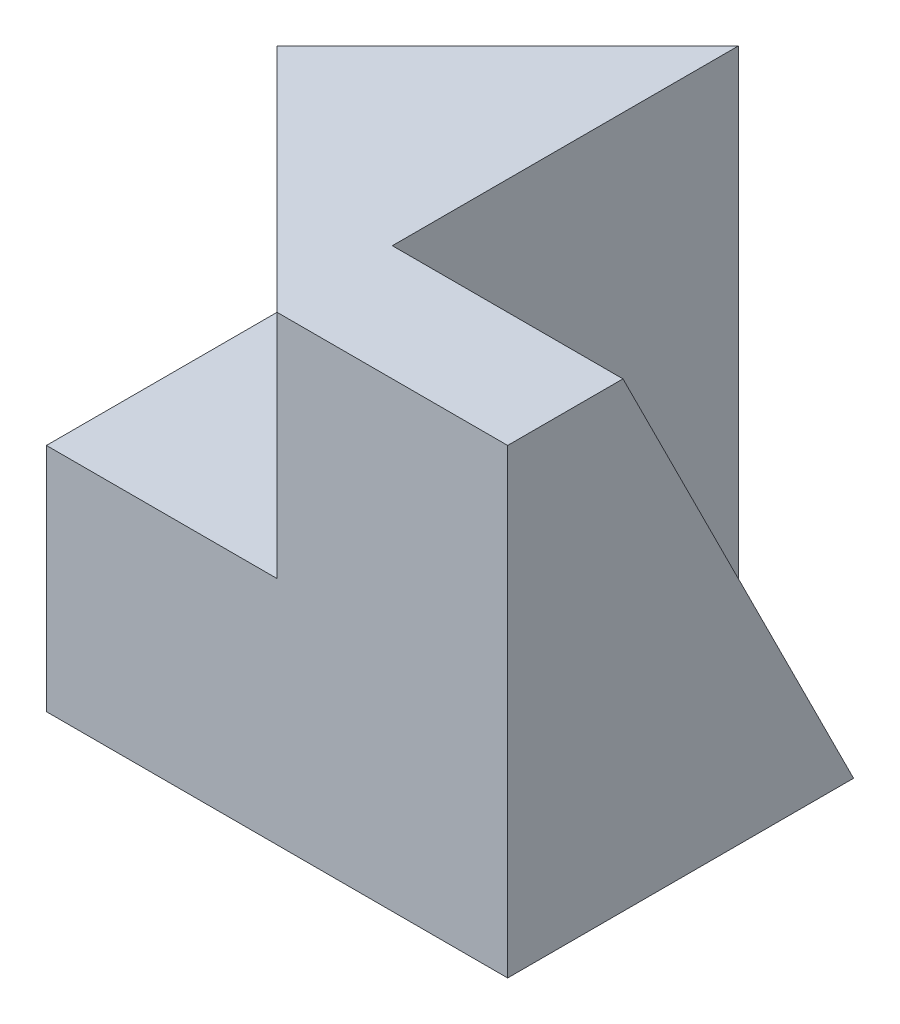
ISO-10303-21;
HEADER;
FILE_DESCRIPTION(('STEP AP214'),'2;1');
FILE_NAME('part.step','',(''),(''),'','','');
FILE_SCHEMA(('AUTOMOTIVE_DESIGN { 1 0 10303 214 1 1 1 1 }'));
ENDSEC;
DATA;
#1=APPLICATION_CONTEXT('core data for automotive mechanical design processes');
#2=APPLICATION_PROTOCOL_DEFINITION('international standard','automotive_design',2000,#1);
#3=PRODUCT_CONTEXT('',#1,'mechanical');
#4=PRODUCT('Part','Part','',(#3));
#5=PRODUCT_RELATED_PRODUCT_CATEGORY('part','',(#4));
#6=PRODUCT_DEFINITION_FORMATION('','',#4);
#7=PRODUCT_DEFINITION_CONTEXT('part definition',#1,'design');
#8=PRODUCT_DEFINITION('design','',#6,#7);
#9=PRODUCT_DEFINITION_SHAPE('','',#8);
#10=(LENGTH_UNIT() NAMED_UNIT(*) SI_UNIT(.MILLI.,.METRE.));
#11=(NAMED_UNIT(*) PLANE_ANGLE_UNIT() SI_UNIT($,.RADIAN.));
#12=(NAMED_UNIT(*) SI_UNIT($,.STERADIAN.) SOLID_ANGLE_UNIT());
#13=UNCERTAINTY_MEASURE_WITH_UNIT(LENGTH_MEASURE(1.E-05),#10,'distance_accuracy_value','');
#14=(GEOMETRIC_REPRESENTATION_CONTEXT(3) GLOBAL_UNCERTAINTY_ASSIGNED_CONTEXT((#13)) GLOBAL_UNIT_ASSIGNED_CONTEXT((#10,
#11,#12)) REPRESENTATION_CONTEXT('',''));
#15=CARTESIAN_POINT('',(0.,0.,0.));
#16=DIRECTION('',(0.,0.,1.));
#17=DIRECTION('',(1.,0.,0.));
#18=AXIS2_PLACEMENT_3D('',#15,#16,#17);
#19=CARTESIAN_POINT('',(40.,0.,40.));
#20=DIRECTION('',(-1.,0.,0.));
#21=DIRECTION('',(0.,0.,1.));
#22=AXIS2_PLACEMENT_3D('',#19,#20,#21);
#23=PLANE('',#22);
#24=DIRECTION('',(0.,0.894427190999916,0.447213595499958));
#25=VECTOR('',#24,1.);
#26=CARTESIAN_POINT('',(40.,-4.,8.));
#27=LINE('',#26,#25);
#28=CARTESIAN_POINT('',(40.,0.,10.));
#29=VERTEX_POINT('',#28);
#30=CARTESIAN_POINT('',(40.,40.,30.));
#31=VERTEX_POINT('',#30);
#32=EDGE_CURVE('E116',#29,#31,#27,.T.);
#33=ORIENTED_EDGE('',*,*,#32,.T.);
#34=DIRECTION('',(0.,0.,-1.));
#35=VECTOR('',#34,1.);
#36=CARTESIAN_POINT('',(40.,40.,40.));
#37=LINE('',#36,#35);
#38=CARTESIAN_POINT('',(40.,40.,40.));
#39=VERTEX_POINT('',#38);
#40=EDGE_CURVE('E139',#39,#31,#37,.T.);
#41=ORIENTED_EDGE('',*,*,#40,.F.);
#42=DIRECTION('',(0.,1.,0.));
#43=VECTOR('',#42,1.);
#44=CARTESIAN_POINT('',(40.,0.,40.));
#45=LINE('',#44,#43);
#46=CARTESIAN_POINT('',(40.,0.,40.));
#47=VERTEX_POINT('',#46);
#48=EDGE_CURVE('E52',#47,#39,#45,.T.);
#49=ORIENTED_EDGE('',*,*,#48,.F.);
#50=DIRECTION('',(0.,0.,-1.));
#51=VECTOR('',#50,1.);
#52=CARTESIAN_POINT('',(40.,0.,40.));
#53=LINE('',#52,#51);
#54=EDGE_CURVE('E142',#47,#29,#53,.T.);
#55=ORIENTED_EDGE('',*,*,#54,.T.);
#56=EDGE_LOOP('',(#33,#41,#49,#55));
#57=FACE_BOUND('',#56,.T.);
#58=ADVANCED_FACE('F37',(#57),#23,.F.);
#59=CARTESIAN_POINT('',(0.,40.,40.));
#60=DIRECTION('',(0.,1.,0.));
#61=DIRECTION('',(0.,0.,1.));
#62=AXIS2_PLACEMENT_3D('',#59,#60,#61);
#63=PLANE('',#62);
#64=DIRECTION('',(0.707106781186548,0.,-0.707106781186547));
#65=VECTOR('',#64,1.);
#66=CARTESIAN_POINT('',(-10.,40.,30.));
#67=LINE('',#66,#65);
#68=CARTESIAN_POINT('',(0.,40.,20.));
#69=VERTEX_POINT('',#68);
#70=CARTESIAN_POINT('',(20.,40.,0.));
#71=VERTEX_POINT('',#70);
#72=EDGE_CURVE('E125',#69,#71,#67,.T.);
#73=ORIENTED_EDGE('',*,*,#72,.F.);
#74=DIRECTION('',(0.707106781186548,0.,0.707106781186548));
#75=VECTOR('',#74,1.);
#76=CARTESIAN_POINT('',(0.,40.,20.));
#77=LINE('',#76,#75);
#78=CARTESIAN_POINT('',(20.,40.,40.));
#79=VERTEX_POINT('',#78);
#80=EDGE_CURVE('E105',#69,#79,#77,.T.);
#81=ORIENTED_EDGE('',*,*,#80,.T.);
#82=DIRECTION('',(1.,0.,0.));
#83=VECTOR('',#82,1.);
#84=CARTESIAN_POINT('',(0.,40.,40.));
#85=LINE('',#84,#83);
#86=EDGE_CURVE('E136',#79,#39,#85,.T.);
#87=ORIENTED_EDGE('',*,*,#86,.T.);
#88=ORIENTED_EDGE('',*,*,#40,.T.);
#89=DIRECTION('',(1.,0.,0.));
#90=VECTOR('',#89,1.);
#91=CARTESIAN_POINT('',(20.,40.,30.));
#92=LINE('',#91,#90);
#93=CARTESIAN_POINT('',(20.,40.,30.));
#94=VERTEX_POINT('',#93);
#95=EDGE_CURVE('E110',#94,#31,#92,.T.);
#96=ORIENTED_EDGE('',*,*,#95,.F.);
#97=DIRECTION('',(0.,0.,1.));
#98=VECTOR('',#97,1.);
#99=CARTESIAN_POINT('',(20.,40.,0.));
#100=LINE('',#99,#98);
#101=EDGE_CURVE('E159',#71,#94,#100,.T.);
#102=ORIENTED_EDGE('',*,*,#101,.F.);
#103=EDGE_LOOP('',(#73,#81,#87,#88,#96,#102));
#104=FACE_BOUND('',#103,.T.);
#105=ADVANCED_FACE('F155',(#104),#63,.T.);
#106=CARTESIAN_POINT('',(0.,20.,40.));
#107=DIRECTION('',(0.,1.,0.));
#108=DIRECTION('',(0.,0.,1.));
#109=AXIS2_PLACEMENT_3D('',#106,#107,#108);
#110=PLANE('',#109);
#111=DIRECTION('',(0.707106781186548,0.,0.707106781186548));
#112=VECTOR('',#111,1.);
#113=CARTESIAN_POINT('',(0.,20.,20.));
#114=LINE('',#113,#112);
#115=CARTESIAN_POINT('',(0.,20.,20.));
#116=VERTEX_POINT('',#115);
#117=CARTESIAN_POINT('',(20.,20.,40.));
#118=VERTEX_POINT('',#117);
#119=EDGE_CURVE('E102',#116,#118,#114,.T.);
#120=ORIENTED_EDGE('',*,*,#119,.F.);
#121=DIRECTION('',(0.,0.,-1.));
#122=VECTOR('',#121,1.);
#123=CARTESIAN_POINT('',(0.,20.,40.));
#124=LINE('',#123,#122);
#125=CARTESIAN_POINT('',(0.,20.,40.));
#126=VERTEX_POINT('',#125);
#127=EDGE_CURVE('E11',#126,#116,#124,.T.);
#128=ORIENTED_EDGE('',*,*,#127,.F.);
#129=DIRECTION('',(1.,0.,0.));
#130=VECTOR('',#129,1.);
#131=CARTESIAN_POINT('',(0.,20.,40.));
#132=LINE('',#131,#130);
#133=EDGE_CURVE('E115',#126,#118,#132,.T.);
#134=ORIENTED_EDGE('',*,*,#133,.T.);
#135=EDGE_LOOP('',(#120,#128,#134));
#136=FACE_BOUND('',#135,.T.);
#137=ADVANCED_FACE('F39',(#136),#110,.T.);
#138=CARTESIAN_POINT('',(0.,0.,40.));
#139=DIRECTION('',(-1.,0.,0.));
#140=DIRECTION('',(0.,0.,1.));
#141=AXIS2_PLACEMENT_3D('',#138,#139,#140);
#142=PLANE('',#141);
#143=DIRECTION('',(0.,-1.,0.));
#144=VECTOR('',#143,1.);
#145=CARTESIAN_POINT('',(0.,52.,20.));
#146=LINE('',#145,#144);
#147=CARTESIAN_POINT('',(0.,0.,20.));
#148=VERTEX_POINT('',#147);
#149=EDGE_CURVE('E119',#116,#148,#146,.T.);
#150=ORIENTED_EDGE('',*,*,#149,.T.);
#151=DIRECTION('',(0.,0.,-1.));
#152=VECTOR('',#151,1.);
#153=CARTESIAN_POINT('',(0.,0.,40.));
#154=LINE('',#153,#152);
#155=CARTESIAN_POINT('',(0.,0.,40.));
#156=VERTEX_POINT('',#155);
#157=EDGE_CURVE('E45',#156,#148,#154,.T.);
#158=ORIENTED_EDGE('',*,*,#157,.F.);
#159=DIRECTION('',(0.,1.,0.));
#160=VECTOR('',#159,1.);
#161=CARTESIAN_POINT('',(0.,0.,40.));
#162=LINE('',#161,#160);
#163=EDGE_CURVE('E129',#156,#126,#162,.T.);
#164=ORIENTED_EDGE('',*,*,#163,.T.);
#165=ORIENTED_EDGE('',*,*,#127,.T.);
#166=EDGE_LOOP('',(#150,#158,#164,#165));
#167=FACE_BOUND('',#166,.T.);
#168=ADVANCED_FACE('F128',(#167),#142,.T.);
#169=CARTESIAN_POINT('',(0.,0.,40.));
#170=DIRECTION('',(0.,1.,0.));
#171=DIRECTION('',(0.,0.,1.));
#172=AXIS2_PLACEMENT_3D('',#169,#170,#171);
#173=PLANE('',#172);
#174=ORIENTED_EDGE('',*,*,#157,.T.);
#175=DIRECTION('',(-0.707106781186548,0.,0.707106781186547));
#176=VECTOR('',#175,1.);
#177=CARTESIAN_POINT('',(20.,0.,0.));
#178=LINE('',#177,#176);
#179=CARTESIAN_POINT('',(20.,0.,0.));
#180=VERTEX_POINT('',#179);
#181=EDGE_CURVE('E122',#180,#148,#178,.T.);
#182=ORIENTED_EDGE('',*,*,#181,.F.);
#183=DIRECTION('',(0.,0.,-1.));
#184=VECTOR('',#183,1.);
#185=CARTESIAN_POINT('',(20.,0.,0.));
#186=LINE('',#185,#184);
#187=CARTESIAN_POINT('',(20.,0.,10.));
#188=VERTEX_POINT('',#187);
#189=EDGE_CURVE('E164',#188,#180,#186,.T.);
#190=ORIENTED_EDGE('',*,*,#189,.F.);
#191=DIRECTION('',(-1.,0.,0.));
#192=VECTOR('',#191,1.);
#193=CARTESIAN_POINT('',(40.,0.,10.));
#194=LINE('',#193,#192);
#195=EDGE_CURVE('E150',#29,#188,#194,.T.);
#196=ORIENTED_EDGE('',*,*,#195,.F.);
#197=ORIENTED_EDGE('',*,*,#54,.F.);
#198=DIRECTION('',(1.,0.,0.));
#199=VECTOR('',#198,1.);
#200=CARTESIAN_POINT('',(0.,0.,40.));
#201=LINE('',#200,#199);
#202=EDGE_CURVE('E57',#156,#47,#201,.T.);
#203=ORIENTED_EDGE('',*,*,#202,.F.);
#204=EDGE_LOOP('',(#174,#182,#190,#196,#197,#203));
#205=FACE_BOUND('',#204,.T.);
#206=ADVANCED_FACE('F145',(#205),#173,.F.);
#207=CARTESIAN_POINT('',(0.,0.,40.));
#208=DIRECTION('',(0.,0.,1.));
#209=DIRECTION('',(1.,0.,0.));
#210=AXIS2_PLACEMENT_3D('',#207,#208,#209);
#211=PLANE('',#210);
#212=DIRECTION('',(0.,1.,0.));
#213=VECTOR('',#212,1.);
#214=CARTESIAN_POINT('',(20.,0.,40.));
#215=LINE('',#214,#213);
#216=EDGE_CURVE('E109',#118,#79,#215,.T.);
#217=ORIENTED_EDGE('',*,*,#216,.F.);
#218=ORIENTED_EDGE('',*,*,#133,.F.);
#219=ORIENTED_EDGE('',*,*,#163,.F.);
#220=ORIENTED_EDGE('',*,*,#202,.T.);
#221=ORIENTED_EDGE('',*,*,#48,.T.);
#222=ORIENTED_EDGE('',*,*,#86,.F.);
#223=EDGE_LOOP('',(#217,#218,#219,#220,#221,#222));
#224=FACE_BOUND('',#223,.T.);
#225=ADVANCED_FACE('F156',(#224),#211,.T.);
#226=CARTESIAN_POINT('',(20.,0.,0.));
#227=DIRECTION('',(1.,0.,0.));
#228=DIRECTION('',(0.,0.,-1.));
#229=AXIS2_PLACEMENT_3D('',#226,#227,#228);
#230=PLANE('',#229);
#231=ORIENTED_EDGE('',*,*,#101,.T.);
#232=DIRECTION('',(0.,0.894427190999916,0.447213595499958));
#233=VECTOR('',#232,1.);
#234=CARTESIAN_POINT('',(20.,-4.,8.));
#235=LINE('',#234,#233);
#236=EDGE_CURVE('E169',#188,#94,#235,.T.);
#237=ORIENTED_EDGE('',*,*,#236,.F.);
#238=ORIENTED_EDGE('',*,*,#189,.T.);
#239=DIRECTION('',(0.,1.,0.));
#240=VECTOR('',#239,1.);
#241=CARTESIAN_POINT('',(20.,0.,0.));
#242=LINE('',#241,#240);
#243=EDGE_CURVE('E161',#180,#71,#242,.T.);
#244=ORIENTED_EDGE('',*,*,#243,.T.);
#245=EDGE_LOOP('',(#231,#237,#238,#244));
#246=FACE_BOUND('',#245,.T.);
#247=ADVANCED_FACE('F177',(#246),#230,.T.);
#248=CARTESIAN_POINT('',(20.,52.,0.));
#249=DIRECTION('',(0.707106781186548,0.,0.707106781186548));
#250=DIRECTION('',(0.707106781186548,0.,-0.707106781186547));
#251=AXIS2_PLACEMENT_3D('',#248,#249,#250);
#252=PLANE('',#251);
#253=ORIENTED_EDGE('',*,*,#72,.T.);
#254=ORIENTED_EDGE('',*,*,#243,.F.);
#255=ORIENTED_EDGE('',*,*,#181,.T.);
#256=ORIENTED_EDGE('',*,*,#149,.F.);
#257=DIRECTION('',(0.,1.,0.));
#258=VECTOR('',#257,1.);
#259=CARTESIAN_POINT('',(0.,40.,20.));
#260=LINE('',#259,#258);
#261=EDGE_CURVE('E99',#116,#69,#260,.T.);
#262=ORIENTED_EDGE('',*,*,#261,.T.);
#263=EDGE_LOOP('',(#253,#254,#255,#256,#262));
#264=FACE_BOUND('',#263,.T.);
#265=ADVANCED_FACE('F120',(#264),#252,.F.);
#266=CARTESIAN_POINT('',(20.,-4.,8.));
#267=DIRECTION('',(0.,0.447213595499958,-0.894427190999916));
#268=DIRECTION('',(0.,0.894427190999916,0.447213595499958));
#269=AXIS2_PLACEMENT_3D('',#266,#267,#268);
#270=PLANE('',#269);
#271=ORIENTED_EDGE('',*,*,#32,.F.);
#272=ORIENTED_EDGE('',*,*,#195,.T.);
#273=ORIENTED_EDGE('',*,*,#236,.T.);
#274=ORIENTED_EDGE('',*,*,#95,.T.);
#275=EDGE_LOOP('',(#271,#272,#273,#274));
#276=FACE_BOUND('',#275,.T.);
#277=ADVANCED_FACE('F174',(#276),#270,.T.);
#278=CARTESIAN_POINT('',(0.,20.,20.));
#279=DIRECTION('',(-0.707106781186548,0.,0.707106781186548));
#280=DIRECTION('',(0.707106781186548,0.,0.707106781186548));
#281=AXIS2_PLACEMENT_3D('',#278,#279,#280);
#282=PLANE('',#281);
#283=ORIENTED_EDGE('',*,*,#80,.F.);
#284=ORIENTED_EDGE('',*,*,#261,.F.);
#285=ORIENTED_EDGE('',*,*,#119,.T.);
#286=ORIENTED_EDGE('',*,*,#216,.T.);
#287=EDGE_LOOP('',(#283,#284,#285,#286));
#288=FACE_BOUND('',#287,.T.);
#289=ADVANCED_FACE('F101',(#288),#282,.T.);
#290=CLOSED_SHELL('',(#58,#105,#137,#168,#206,#225,#247,#265,#277,#289));
#291=MANIFOLD_SOLID_BREP('B2',#290);
#292=ADVANCED_BREP_SHAPE_REPRESENTATION('',(#18,#291),#14);
#293=SHAPE_DEFINITION_REPRESENTATION(#9,#292);
ENDSEC;
END-ISO-10303-21;
